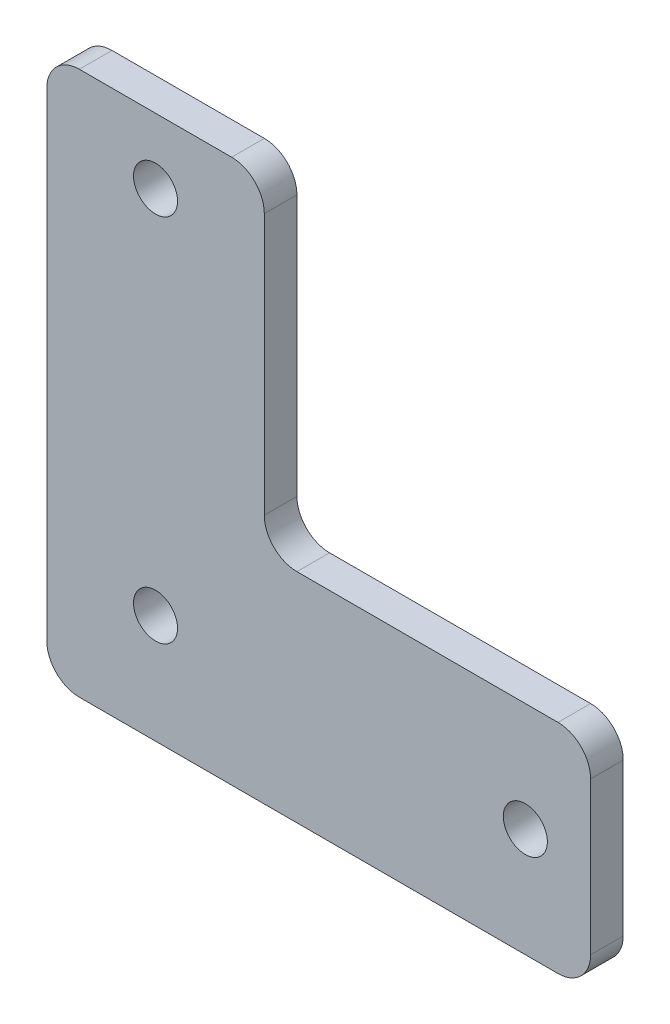
ISO-10303-21;
HEADER;
FILE_DESCRIPTION(('STEP AP214'),'2;1');
FILE_NAME('part.step','',(''),(''),'','','');
FILE_SCHEMA(('AUTOMOTIVE_DESIGN { 1 0 10303 214 1 1 1 1 }'));
ENDSEC;
DATA;
#1=APPLICATION_CONTEXT('core data for automotive mechanical design processes');
#2=APPLICATION_PROTOCOL_DEFINITION('international standard','automotive_design',2000,#1);
#3=PRODUCT_CONTEXT('',#1,'mechanical');
#4=PRODUCT('Part','Part','',(#3));
#5=PRODUCT_RELATED_PRODUCT_CATEGORY('part','',(#4));
#6=PRODUCT_DEFINITION_FORMATION('','',#4);
#7=PRODUCT_DEFINITION_CONTEXT('part definition',#1,'design');
#8=PRODUCT_DEFINITION('design','',#6,#7);
#9=PRODUCT_DEFINITION_SHAPE('','',#8);
#10=(LENGTH_UNIT() NAMED_UNIT(*) SI_UNIT(.MILLI.,.METRE.));
#11=(NAMED_UNIT(*) PLANE_ANGLE_UNIT() SI_UNIT($,.RADIAN.));
#12=(NAMED_UNIT(*) SI_UNIT($,.STERADIAN.) SOLID_ANGLE_UNIT());
#13=UNCERTAINTY_MEASURE_WITH_UNIT(LENGTH_MEASURE(1.E-05),#10,'distance_accuracy_value','');
#14=(GEOMETRIC_REPRESENTATION_CONTEXT(3) GLOBAL_UNCERTAINTY_ASSIGNED_CONTEXT((#13)) GLOBAL_UNIT_ASSIGNED_CONTEXT((#10,
#11,#12)) REPRESENTATION_CONTEXT('',''));
#15=CARTESIAN_POINT('',(0.,0.,0.));
#16=DIRECTION('',(0.,0.,1.));
#17=DIRECTION('',(1.,0.,0.));
#18=AXIS2_PLACEMENT_3D('',#15,#16,#17);
#19=CARTESIAN_POINT('',(50.,0.,3.));
#20=DIRECTION('',(0.,1.,0.));
#21=DIRECTION('',(-1.,0.,0.));
#22=AXIS2_PLACEMENT_3D('',#19,#20,#21);
#23=PLANE('',#22);
#24=DIRECTION('',(1.,0.,0.));
#25=VECTOR('',#24,1.);
#26=CARTESIAN_POINT('',(50.,0.,3.));
#27=LINE('',#26,#25);
#28=CARTESIAN_POINT('',(3.,0.,3.));
#29=VERTEX_POINT('',#28);
#30=CARTESIAN_POINT('',(47.,0.,3.));
#31=VERTEX_POINT('',#30);
#32=EDGE_CURVE('E144',#29,#31,#27,.T.);
#33=ORIENTED_EDGE('',*,*,#32,.F.);
#34=DIRECTION('',(0.,0.,-1.));
#35=VECTOR('',#34,1.);
#36=CARTESIAN_POINT('',(3.,0.,3.));
#37=LINE('',#36,#35);
#38=CARTESIAN_POINT('',(3.,0.,0.));
#39=VERTEX_POINT('',#38);
#40=EDGE_CURVE('E129',#29,#39,#37,.T.);
#41=ORIENTED_EDGE('',*,*,#40,.T.);
#42=DIRECTION('',(1.,0.,0.));
#43=VECTOR('',#42,1.);
#44=CARTESIAN_POINT('',(50.,0.,0.));
#45=LINE('',#44,#43);
#46=CARTESIAN_POINT('',(47.,0.,0.));
#47=VERTEX_POINT('',#46);
#48=EDGE_CURVE('E141',#39,#47,#45,.T.);
#49=ORIENTED_EDGE('',*,*,#48,.T.);
#50=DIRECTION('',(0.,0.,-1.));
#51=VECTOR('',#50,1.);
#52=CARTESIAN_POINT('',(47.,0.,3.));
#53=LINE('',#52,#51);
#54=EDGE_CURVE('E146',#47,#31,#53,.F.);
#55=ORIENTED_EDGE('',*,*,#54,.T.);
#56=EDGE_LOOP('',(#33,#41,#49,#55));
#57=FACE_BOUND('',#56,.T.);
#58=ADVANCED_FACE('F35',(#57),#23,.F.);
#59=CARTESIAN_POINT('',(50.,20.,3.));
#60=DIRECTION('',(-1.,0.,0.));
#61=DIRECTION('',(0.,0.,1.));
#62=AXIS2_PLACEMENT_3D('',#59,#60,#61);
#63=PLANE('',#62);
#64=DIRECTION('',(0.,1.,0.));
#65=VECTOR('',#64,1.);
#66=CARTESIAN_POINT('',(50.,20.,3.));
#67=LINE('',#66,#65);
#68=CARTESIAN_POINT('',(50.,3.,3.));
#69=VERTEX_POINT('',#68);
#70=CARTESIAN_POINT('',(50.,17.,3.));
#71=VERTEX_POINT('',#70);
#72=EDGE_CURVE('E231',#69,#71,#67,.T.);
#73=ORIENTED_EDGE('',*,*,#72,.F.);
#74=DIRECTION('',(0.,0.,-1.));
#75=VECTOR('',#74,1.);
#76=CARTESIAN_POINT('',(50.,3.,3.));
#77=LINE('',#76,#75);
#78=CARTESIAN_POINT('',(50.,3.,0.));
#79=VERTEX_POINT('',#78);
#80=EDGE_CURVE('E207',#69,#79,#77,.T.);
#81=ORIENTED_EDGE('',*,*,#80,.T.);
#82=DIRECTION('',(0.,1.,0.));
#83=VECTOR('',#82,1.);
#84=CARTESIAN_POINT('',(50.,20.,0.));
#85=LINE('',#84,#83);
#86=CARTESIAN_POINT('',(50.,17.,0.));
#87=VERTEX_POINT('',#86);
#88=EDGE_CURVE('E151',#79,#87,#85,.T.);
#89=ORIENTED_EDGE('',*,*,#88,.T.);
#90=DIRECTION('',(0.,0.,-1.));
#91=VECTOR('',#90,1.);
#92=CARTESIAN_POINT('',(50.,17.,3.));
#93=LINE('',#92,#91);
#94=EDGE_CURVE('E205',#87,#71,#93,.F.);
#95=ORIENTED_EDGE('',*,*,#94,.T.);
#96=EDGE_LOOP('',(#73,#81,#89,#95));
#97=FACE_BOUND('',#96,.T.);
#98=ADVANCED_FACE('F280',(#97),#63,.F.);
#99=CARTESIAN_POINT('',(20.,20.,3.));
#100=DIRECTION('',(0.,-1.,0.));
#101=DIRECTION('',(0.,0.,-1.));
#102=AXIS2_PLACEMENT_3D('',#99,#100,#101);
#103=PLANE('',#102);
#104=DIRECTION('',(-1.,0.,0.));
#105=VECTOR('',#104,1.);
#106=CARTESIAN_POINT('',(20.,20.,0.));
#107=LINE('',#106,#105);
#108=CARTESIAN_POINT('',(47.,20.,0.));
#109=VERTEX_POINT('',#108);
#110=CARTESIAN_POINT('',(23.,20.,0.));
#111=VERTEX_POINT('',#110);
#112=EDGE_CURVE('E155',#109,#111,#107,.T.);
#113=ORIENTED_EDGE('',*,*,#112,.T.);
#114=DIRECTION('',(0.,0.,-1.));
#115=VECTOR('',#114,1.);
#116=CARTESIAN_POINT('',(23.,20.,3.));
#117=LINE('',#116,#115);
#118=CARTESIAN_POINT('',(23.,20.,3.));
#119=VERTEX_POINT('',#118);
#120=EDGE_CURVE('E203',#111,#119,#117,.F.);
#121=ORIENTED_EDGE('',*,*,#120,.T.);
#122=DIRECTION('',(-1.,0.,0.));
#123=VECTOR('',#122,1.);
#124=CARTESIAN_POINT('',(20.,20.,3.));
#125=LINE('',#124,#123);
#126=CARTESIAN_POINT('',(47.,20.,3.));
#127=VERTEX_POINT('',#126);
#128=EDGE_CURVE('E225',#127,#119,#125,.T.);
#129=ORIENTED_EDGE('',*,*,#128,.F.);
#130=DIRECTION('',(0.,0.,-1.));
#131=VECTOR('',#130,1.);
#132=CARTESIAN_POINT('',(47.,20.,3.));
#133=LINE('',#132,#131);
#134=EDGE_CURVE('E200',#127,#109,#133,.T.);
#135=ORIENTED_EDGE('',*,*,#134,.T.);
#136=EDGE_LOOP('',(#113,#121,#129,#135));
#137=FACE_BOUND('',#136,.T.);
#138=ADVANCED_FACE('F215',(#137),#103,.F.);
#139=CARTESIAN_POINT('',(20.,50.,3.));
#140=DIRECTION('',(-1.,0.,0.));
#141=DIRECTION('',(0.,-1.,0.));
#142=AXIS2_PLACEMENT_3D('',#139,#140,#141);
#143=PLANE('',#142);
#144=DIRECTION('',(0.,1.,0.));
#145=VECTOR('',#144,1.);
#146=CARTESIAN_POINT('',(20.,50.,0.));
#147=LINE('',#146,#145);
#148=CARTESIAN_POINT('',(20.,23.,0.));
#149=VERTEX_POINT('',#148);
#150=CARTESIAN_POINT('',(20.,47.,0.));
#151=VERTEX_POINT('',#150);
#152=EDGE_CURVE('E166',#149,#151,#147,.T.);
#153=ORIENTED_EDGE('',*,*,#152,.T.);
#154=DIRECTION('',(0.,0.,-1.));
#155=VECTOR('',#154,1.);
#156=CARTESIAN_POINT('',(20.,47.,3.));
#157=LINE('',#156,#155);
#158=CARTESIAN_POINT('',(20.,47.,3.));
#159=VERTEX_POINT('',#158);
#160=EDGE_CURVE('E198',#151,#159,#157,.F.);
#161=ORIENTED_EDGE('',*,*,#160,.T.);
#162=DIRECTION('',(0.,1.,0.));
#163=VECTOR('',#162,1.);
#164=CARTESIAN_POINT('',(20.,50.,3.));
#165=LINE('',#164,#163);
#166=CARTESIAN_POINT('',(20.,23.,3.));
#167=VERTEX_POINT('',#166);
#168=EDGE_CURVE('E224',#167,#159,#165,.T.);
#169=ORIENTED_EDGE('',*,*,#168,.F.);
#170=DIRECTION('',(0.,0.,-1.));
#171=VECTOR('',#170,1.);
#172=CARTESIAN_POINT('',(20.,23.,0.));
#173=LINE('',#172,#171);
#174=EDGE_CURVE('E195',#167,#149,#173,.T.);
#175=ORIENTED_EDGE('',*,*,#174,.T.);
#176=EDGE_LOOP('',(#153,#161,#169,#175));
#177=FACE_BOUND('',#176,.T.);
#178=ADVANCED_FACE('F227',(#177),#143,.F.);
#179=CARTESIAN_POINT('',(0.,50.,3.));
#180=DIRECTION('',(0.,-1.,0.));
#181=DIRECTION('',(0.,0.,-1.));
#182=AXIS2_PLACEMENT_3D('',#179,#180,#181);
#183=PLANE('',#182);
#184=DIRECTION('',(-1.,0.,0.));
#185=VECTOR('',#184,1.);
#186=CARTESIAN_POINT('',(0.,50.,0.));
#187=LINE('',#186,#185);
#188=CARTESIAN_POINT('',(17.,50.,0.));
#189=VERTEX_POINT('',#188);
#190=CARTESIAN_POINT('',(3.,50.,0.));
#191=VERTEX_POINT('',#190);
#192=EDGE_CURVE('E169',#189,#191,#187,.T.);
#193=ORIENTED_EDGE('',*,*,#192,.T.);
#194=DIRECTION('',(0.,0.,-1.));
#195=VECTOR('',#194,1.);
#196=CARTESIAN_POINT('',(3.,50.,3.));
#197=LINE('',#196,#195);
#198=CARTESIAN_POINT('',(3.,50.,3.));
#199=VERTEX_POINT('',#198);
#200=EDGE_CURVE('E50',#191,#199,#197,.F.);
#201=ORIENTED_EDGE('',*,*,#200,.T.);
#202=DIRECTION('',(-1.,0.,0.));
#203=VECTOR('',#202,1.);
#204=CARTESIAN_POINT('',(0.,50.,3.));
#205=LINE('',#204,#203);
#206=CARTESIAN_POINT('',(17.,50.,3.));
#207=VERTEX_POINT('',#206);
#208=EDGE_CURVE('E229',#207,#199,#205,.T.);
#209=ORIENTED_EDGE('',*,*,#208,.F.);
#210=DIRECTION('',(0.,0.,-1.));
#211=VECTOR('',#210,1.);
#212=CARTESIAN_POINT('',(17.,50.,3.));
#213=LINE('',#212,#211);
#214=EDGE_CURVE('E191',#207,#189,#213,.T.);
#215=ORIENTED_EDGE('',*,*,#214,.T.);
#216=EDGE_LOOP('',(#193,#201,#209,#215));
#217=FACE_BOUND('',#216,.T.);
#218=ADVANCED_FACE('F317',(#217),#183,.F.);
#219=CARTESIAN_POINT('',(0.,0.,3.));
#220=DIRECTION('',(1.,0.,0.));
#221=DIRECTION('',(0.,0.,-1.));
#222=AXIS2_PLACEMENT_3D('',#219,#220,#221);
#223=PLANE('',#222);
#224=DIRECTION('',(0.,-1.,0.));
#225=VECTOR('',#224,1.);
#226=CARTESIAN_POINT('',(0.,0.,0.));
#227=LINE('',#226,#225);
#228=CARTESIAN_POINT('',(0.,47.,0.));
#229=VERTEX_POINT('',#228);
#230=CARTESIAN_POINT('',(0.,3.,0.));
#231=VERTEX_POINT('',#230);
#232=EDGE_CURVE('E171',#229,#231,#227,.T.);
#233=ORIENTED_EDGE('',*,*,#232,.T.);
#234=DIRECTION('',(0.,0.,-1.));
#235=VECTOR('',#234,1.);
#236=CARTESIAN_POINT('',(0.,3.,3.));
#237=LINE('',#236,#235);
#238=CARTESIAN_POINT('',(0.,3.,3.));
#239=VERTEX_POINT('',#238);
#240=EDGE_CURVE('E130',#231,#239,#237,.F.);
#241=ORIENTED_EDGE('',*,*,#240,.T.);
#242=DIRECTION('',(0.,-1.,0.));
#243=VECTOR('',#242,1.);
#244=CARTESIAN_POINT('',(0.,0.,3.));
#245=LINE('',#244,#243);
#246=CARTESIAN_POINT('',(0.,47.,3.));
#247=VERTEX_POINT('',#246);
#248=EDGE_CURVE('E161',#247,#239,#245,.T.);
#249=ORIENTED_EDGE('',*,*,#248,.F.);
#250=DIRECTION('',(0.,0.,-1.));
#251=VECTOR('',#250,1.);
#252=CARTESIAN_POINT('',(0.,47.,3.));
#253=LINE('',#252,#251);
#254=EDGE_CURVE('E135',#247,#229,#253,.T.);
#255=ORIENTED_EDGE('',*,*,#254,.T.);
#256=EDGE_LOOP('',(#233,#241,#249,#255));
#257=FACE_BOUND('',#256,.T.);
#258=ADVANCED_FACE('F264',(#257),#223,.F.);
#259=CARTESIAN_POINT('',(0.,0.,3.));
#260=DIRECTION('',(0.,0.,-1.));
#261=DIRECTION('',(-1.,0.,0.));
#262=AXIS2_PLACEMENT_3D('',#259,#260,#261);
#263=PLANE('',#262);
#264=CARTESIAN_POINT('',(44.,10.,3.));
#265=DIRECTION('',(0.,0.,1.));
#266=DIRECTION('',(1.,0.,0.));
#267=AXIS2_PLACEMENT_3D('',#264,#265,#266);
#268=CIRCLE('',#267,2.025);
#269=CARTESIAN_POINT('',(46.025,10.,3.));
#270=VERTEX_POINT('',#269);
#271=EDGE_CURVE('E240',#270,#270,#268,.T.);
#272=ORIENTED_EDGE('',*,*,#271,.F.);
#273=EDGE_LOOP('',(#272));
#274=FACE_BOUND('',#273,.T.);
#275=CARTESIAN_POINT('',(10.,44.,3.));
#276=DIRECTION('',(0.,0.,1.));
#277=DIRECTION('',(1.,0.,0.));
#278=AXIS2_PLACEMENT_3D('',#275,#276,#277);
#279=CIRCLE('',#278,2.025);
#280=CARTESIAN_POINT('',(12.025,44.,3.));
#281=VERTEX_POINT('',#280);
#282=EDGE_CURVE('E246',#281,#281,#279,.T.);
#283=ORIENTED_EDGE('',*,*,#282,.F.);
#284=EDGE_LOOP('',(#283));
#285=FACE_BOUND('',#284,.T.);
#286=CARTESIAN_POINT('',(10.,10.,3.));
#287=DIRECTION('',(0.,0.,1.));
#288=DIRECTION('',(1.,0.,0.));
#289=AXIS2_PLACEMENT_3D('',#286,#287,#288);
#290=CIRCLE('',#289,2.025);
#291=CARTESIAN_POINT('',(12.025,10.,3.));
#292=VERTEX_POINT('',#291);
#293=EDGE_CURVE('E158',#292,#292,#290,.T.);
#294=ORIENTED_EDGE('',*,*,#293,.F.);
#295=EDGE_LOOP('',(#294));
#296=FACE_BOUND('',#295,.T.);
#297=ORIENTED_EDGE('',*,*,#248,.T.);
#298=CARTESIAN_POINT('',(3.,3.,3.));
#299=DIRECTION('',(0.,0.,-1.));
#300=DIRECTION('',(-1.,0.,0.));
#301=AXIS2_PLACEMENT_3D('',#298,#299,#300);
#302=CIRCLE('',#301,3.);
#303=EDGE_CURVE('E189',#239,#29,#302,.F.);
#304=ORIENTED_EDGE('',*,*,#303,.T.);
#305=ORIENTED_EDGE('',*,*,#32,.T.);
#306=CARTESIAN_POINT('',(47.,3.,3.));
#307=DIRECTION('',(0.,0.,-1.));
#308=DIRECTION('',(-1.,0.,0.));
#309=AXIS2_PLACEMENT_3D('',#306,#307,#308);
#310=CIRCLE('',#309,3.);
#311=EDGE_CURVE('E184',#31,#69,#310,.F.);
#312=ORIENTED_EDGE('',*,*,#311,.T.);
#313=ORIENTED_EDGE('',*,*,#72,.T.);
#314=CARTESIAN_POINT('',(47.,17.,3.));
#315=DIRECTION('',(0.,0.,-1.));
#316=DIRECTION('',(-1.,0.,0.));
#317=AXIS2_PLACEMENT_3D('',#314,#315,#316);
#318=CIRCLE('',#317,3.);
#319=EDGE_CURVE('E182',#71,#127,#318,.F.);
#320=ORIENTED_EDGE('',*,*,#319,.T.);
#321=ORIENTED_EDGE('',*,*,#128,.T.);
#322=CARTESIAN_POINT('',(23.,23.,3.));
#323=DIRECTION('',(0.,0.,-1.));
#324=DIRECTION('',(-1.,0.,0.));
#325=AXIS2_PLACEMENT_3D('',#322,#323,#324);
#326=CIRCLE('',#325,3.);
#327=EDGE_CURVE('E11',#119,#167,#326,.T.);
#328=ORIENTED_EDGE('',*,*,#327,.T.);
#329=ORIENTED_EDGE('',*,*,#168,.T.);
#330=CARTESIAN_POINT('',(17.,47.,3.));
#331=DIRECTION('',(0.,0.,-1.));
#332=DIRECTION('',(-1.,0.,0.));
#333=AXIS2_PLACEMENT_3D('',#330,#331,#332);
#334=CIRCLE('',#333,3.);
#335=EDGE_CURVE('E57',#159,#207,#334,.F.);
#336=ORIENTED_EDGE('',*,*,#335,.T.);
#337=ORIENTED_EDGE('',*,*,#208,.T.);
#338=CARTESIAN_POINT('',(3.,47.,3.));
#339=DIRECTION('',(0.,0.,-1.));
#340=DIRECTION('',(-1.,0.,0.));
#341=AXIS2_PLACEMENT_3D('',#338,#339,#340);
#342=CIRCLE('',#341,3.);
#343=EDGE_CURVE('E187',#199,#247,#342,.F.);
#344=ORIENTED_EDGE('',*,*,#343,.T.);
#345=EDGE_LOOP('',(#297,#304,#305,#312,#313,#320,#321,#328,#329,#336,#337,#344));
#346=FACE_BOUND('',#345,.T.);
#347=ADVANCED_FACE('F223',(#274,#285,#296,#346),#263,.F.);
#348=CARTESIAN_POINT('',(0.,0.,0.));
#349=DIRECTION('',(0.,0.,-1.));
#350=DIRECTION('',(-1.,0.,0.));
#351=AXIS2_PLACEMENT_3D('',#348,#349,#350);
#352=PLANE('',#351);
#353=CARTESIAN_POINT('',(44.,10.,0.));
#354=DIRECTION('',(0.,0.,1.));
#355=DIRECTION('',(1.,0.,0.));
#356=AXIS2_PLACEMENT_3D('',#353,#354,#355);
#357=CIRCLE('',#356,2.025);
#358=CARTESIAN_POINT('',(46.025,10.,0.));
#359=VERTEX_POINT('',#358);
#360=EDGE_CURVE('E243',#359,#359,#357,.T.);
#361=ORIENTED_EDGE('',*,*,#360,.T.);
#362=EDGE_LOOP('',(#361));
#363=FACE_BOUND('',#362,.T.);
#364=CARTESIAN_POINT('',(10.,44.,0.));
#365=DIRECTION('',(0.,0.,1.));
#366=DIRECTION('',(1.,0.,0.));
#367=AXIS2_PLACEMENT_3D('',#364,#365,#366);
#368=CIRCLE('',#367,2.025);
#369=CARTESIAN_POINT('',(12.025,44.,0.));
#370=VERTEX_POINT('',#369);
#371=EDGE_CURVE('E238',#370,#370,#368,.T.);
#372=ORIENTED_EDGE('',*,*,#371,.T.);
#373=EDGE_LOOP('',(#372));
#374=FACE_BOUND('',#373,.T.);
#375=CARTESIAN_POINT('',(10.,10.,0.));
#376=DIRECTION('',(0.,0.,1.));
#377=DIRECTION('',(1.,0.,0.));
#378=AXIS2_PLACEMENT_3D('',#375,#376,#377);
#379=CIRCLE('',#378,2.025);
#380=CARTESIAN_POINT('',(12.025,10.,0.));
#381=VERTEX_POINT('',#380);
#382=EDGE_CURVE('E152',#381,#381,#379,.T.);
#383=ORIENTED_EDGE('',*,*,#382,.T.);
#384=EDGE_LOOP('',(#383));
#385=FACE_BOUND('',#384,.T.);
#386=ORIENTED_EDGE('',*,*,#48,.F.);
#387=CARTESIAN_POINT('',(3.,3.,0.));
#388=DIRECTION('',(0.,0.,-1.));
#389=DIRECTION('',(-1.,0.,0.));
#390=AXIS2_PLACEMENT_3D('',#387,#388,#389);
#391=CIRCLE('',#390,3.);
#392=EDGE_CURVE('E125',#39,#231,#391,.T.);
#393=ORIENTED_EDGE('',*,*,#392,.T.);
#394=ORIENTED_EDGE('',*,*,#232,.F.);
#395=CARTESIAN_POINT('',(3.,47.,0.));
#396=DIRECTION('',(0.,0.,-1.));
#397=DIRECTION('',(-1.,0.,0.));
#398=AXIS2_PLACEMENT_3D('',#395,#396,#397);
#399=CIRCLE('',#398,3.);
#400=EDGE_CURVE('E136',#229,#191,#399,.T.);
#401=ORIENTED_EDGE('',*,*,#400,.T.);
#402=ORIENTED_EDGE('',*,*,#192,.F.);
#403=CARTESIAN_POINT('',(17.,47.,0.));
#404=DIRECTION('',(0.,0.,-1.));
#405=DIRECTION('',(-1.,0.,0.));
#406=AXIS2_PLACEMENT_3D('',#403,#404,#405);
#407=CIRCLE('',#406,3.);
#408=EDGE_CURVE('E176',#189,#151,#407,.T.);
#409=ORIENTED_EDGE('',*,*,#408,.T.);
#410=ORIENTED_EDGE('',*,*,#152,.F.);
#411=CARTESIAN_POINT('',(23.,23.,0.));
#412=DIRECTION('',(0.,0.,-1.));
#413=DIRECTION('',(-1.,0.,0.));
#414=AXIS2_PLACEMENT_3D('',#411,#412,#413);
#415=CIRCLE('',#414,3.);
#416=EDGE_CURVE('E43',#149,#111,#415,.F.);
#417=ORIENTED_EDGE('',*,*,#416,.T.);
#418=ORIENTED_EDGE('',*,*,#112,.F.);
#419=CARTESIAN_POINT('',(47.,17.,0.));
#420=DIRECTION('',(0.,0.,-1.));
#421=DIRECTION('',(-1.,0.,0.));
#422=AXIS2_PLACEMENT_3D('',#419,#420,#421);
#423=CIRCLE('',#422,3.);
#424=EDGE_CURVE('E145',#109,#87,#423,.T.);
#425=ORIENTED_EDGE('',*,*,#424,.T.);
#426=ORIENTED_EDGE('',*,*,#88,.F.);
#427=CARTESIAN_POINT('',(47.,3.,0.));
#428=DIRECTION('',(0.,0.,-1.));
#429=DIRECTION('',(-1.,0.,0.));
#430=AXIS2_PLACEMENT_3D('',#427,#428,#429);
#431=CIRCLE('',#430,3.);
#432=EDGE_CURVE('E150',#79,#47,#431,.T.);
#433=ORIENTED_EDGE('',*,*,#432,.T.);
#434=EDGE_LOOP('',(#386,#393,#394,#401,#402,#409,#410,#417,#418,#425,#426,#433));
#435=FACE_BOUND('',#434,.T.);
#436=ADVANCED_FACE('F148',(#363,#374,#385,#435),#352,.T.);
#437=CARTESIAN_POINT('',(10.,10.,0.));
#438=DIRECTION('',(0.,0.,1.));
#439=DIRECTION('',(1.,0.,0.));
#440=AXIS2_PLACEMENT_3D('',#437,#438,#439);
#441=CYLINDRICAL_SURFACE('',#440,2.025);
#442=ORIENTED_EDGE('',*,*,#382,.F.);
#443=EDGE_LOOP('',(#442));
#444=FACE_BOUND('',#443,.T.);
#445=ORIENTED_EDGE('',*,*,#293,.T.);
#446=EDGE_LOOP('',(#445));
#447=FACE_BOUND('',#446,.T.);
#448=ADVANCED_FACE('F258',(#444,#447),#441,.F.);
#449=CARTESIAN_POINT('',(10.,44.,0.));
#450=DIRECTION('',(0.,0.,1.));
#451=DIRECTION('',(1.,0.,0.));
#452=AXIS2_PLACEMENT_3D('',#449,#450,#451);
#453=CYLINDRICAL_SURFACE('',#452,2.025);
#454=ORIENTED_EDGE('',*,*,#371,.F.);
#455=EDGE_LOOP('',(#454));
#456=FACE_BOUND('',#455,.T.);
#457=ORIENTED_EDGE('',*,*,#282,.T.);
#458=EDGE_LOOP('',(#457));
#459=FACE_BOUND('',#458,.T.);
#460=ADVANCED_FACE('F254',(#456,#459),#453,.F.);
#461=CARTESIAN_POINT('',(44.,10.,0.));
#462=DIRECTION('',(0.,0.,1.));
#463=DIRECTION('',(1.,0.,0.));
#464=AXIS2_PLACEMENT_3D('',#461,#462,#463);
#465=CYLINDRICAL_SURFACE('',#464,2.025);
#466=ORIENTED_EDGE('',*,*,#360,.F.);
#467=EDGE_LOOP('',(#466));
#468=FACE_BOUND('',#467,.T.);
#469=ORIENTED_EDGE('',*,*,#271,.T.);
#470=EDGE_LOOP('',(#469));
#471=FACE_BOUND('',#470,.T.);
#472=ADVANCED_FACE('F257',(#468,#471),#465,.F.);
#473=CARTESIAN_POINT('',(3.,3.,3.));
#474=DIRECTION('',(0.,0.,-1.));
#475=DIRECTION('',(-1.,0.,0.));
#476=AXIS2_PLACEMENT_3D('',#473,#474,#475);
#477=CYLINDRICAL_SURFACE('',#476,3.);
#478=ORIENTED_EDGE('',*,*,#303,.F.);
#479=ORIENTED_EDGE('',*,*,#240,.F.);
#480=ORIENTED_EDGE('',*,*,#392,.F.);
#481=ORIENTED_EDGE('',*,*,#40,.F.);
#482=EDGE_LOOP('',(#478,#479,#480,#481));
#483=FACE_BOUND('',#482,.T.);
#484=ADVANCED_FACE('F128',(#483),#477,.T.);
#485=CARTESIAN_POINT('',(3.,47.,3.));
#486=DIRECTION('',(0.,0.,-1.));
#487=DIRECTION('',(-1.,0.,0.));
#488=AXIS2_PLACEMENT_3D('',#485,#486,#487);
#489=CYLINDRICAL_SURFACE('',#488,3.);
#490=ORIENTED_EDGE('',*,*,#343,.F.);
#491=ORIENTED_EDGE('',*,*,#200,.F.);
#492=ORIENTED_EDGE('',*,*,#400,.F.);
#493=ORIENTED_EDGE('',*,*,#254,.F.);
#494=EDGE_LOOP('',(#490,#491,#492,#493));
#495=FACE_BOUND('',#494,.T.);
#496=ADVANCED_FACE('F291',(#495),#489,.T.);
#497=CARTESIAN_POINT('',(17.,47.,3.));
#498=DIRECTION('',(0.,0.,-1.));
#499=DIRECTION('',(-1.,0.,0.));
#500=AXIS2_PLACEMENT_3D('',#497,#498,#499);
#501=CYLINDRICAL_SURFACE('',#500,3.);
#502=ORIENTED_EDGE('',*,*,#335,.F.);
#503=ORIENTED_EDGE('',*,*,#160,.F.);
#504=ORIENTED_EDGE('',*,*,#408,.F.);
#505=ORIENTED_EDGE('',*,*,#214,.F.);
#506=EDGE_LOOP('',(#502,#503,#504,#505));
#507=FACE_BOUND('',#506,.T.);
#508=ADVANCED_FACE('F294',(#507),#501,.T.);
#509=CARTESIAN_POINT('',(23.,23.,3.));
#510=DIRECTION('',(0.,0.,1.));
#511=DIRECTION('',(1.,0.,0.));
#512=AXIS2_PLACEMENT_3D('',#509,#510,#511);
#513=CYLINDRICAL_SURFACE('',#512,3.);
#514=ORIENTED_EDGE('',*,*,#327,.F.);
#515=ORIENTED_EDGE('',*,*,#120,.F.);
#516=ORIENTED_EDGE('',*,*,#416,.F.);
#517=ORIENTED_EDGE('',*,*,#174,.F.);
#518=EDGE_LOOP('',(#514,#515,#516,#517));
#519=FACE_BOUND('',#518,.T.);
#520=ADVANCED_FACE('F220',(#519),#513,.F.);
#521=CARTESIAN_POINT('',(47.,3.,3.));
#522=DIRECTION('',(0.,0.,-1.));
#523=DIRECTION('',(-1.,0.,0.));
#524=AXIS2_PLACEMENT_3D('',#521,#522,#523);
#525=CYLINDRICAL_SURFACE('',#524,3.);
#526=ORIENTED_EDGE('',*,*,#311,.F.);
#527=ORIENTED_EDGE('',*,*,#54,.F.);
#528=ORIENTED_EDGE('',*,*,#432,.F.);
#529=ORIENTED_EDGE('',*,*,#80,.F.);
#530=EDGE_LOOP('',(#526,#527,#528,#529));
#531=FACE_BOUND('',#530,.T.);
#532=ADVANCED_FACE('F300',(#531),#525,.T.);
#533=CARTESIAN_POINT('',(47.,17.,3.));
#534=DIRECTION('',(0.,0.,-1.));
#535=DIRECTION('',(-1.,0.,0.));
#536=AXIS2_PLACEMENT_3D('',#533,#534,#535);
#537=CYLINDRICAL_SURFACE('',#536,3.);
#538=ORIENTED_EDGE('',*,*,#319,.F.);
#539=ORIENTED_EDGE('',*,*,#94,.F.);
#540=ORIENTED_EDGE('',*,*,#424,.F.);
#541=ORIENTED_EDGE('',*,*,#134,.F.);
#542=EDGE_LOOP('',(#538,#539,#540,#541));
#543=FACE_BOUND('',#542,.T.);
#544=ADVANCED_FACE('F37',(#543),#537,.T.);
#545=CLOSED_SHELL('',(#58,#98,#138,#178,#218,#258,#347,#436,#448,#460,#472,#484,#496,#508,#520,
#532,#544));
#546=MANIFOLD_SOLID_BREP('B2',#545);
#547=ADVANCED_BREP_SHAPE_REPRESENTATION('',(#18,#546),#14);
#548=SHAPE_DEFINITION_REPRESENTATION(#9,#547);
ENDSEC;
END-ISO-10303-21;
